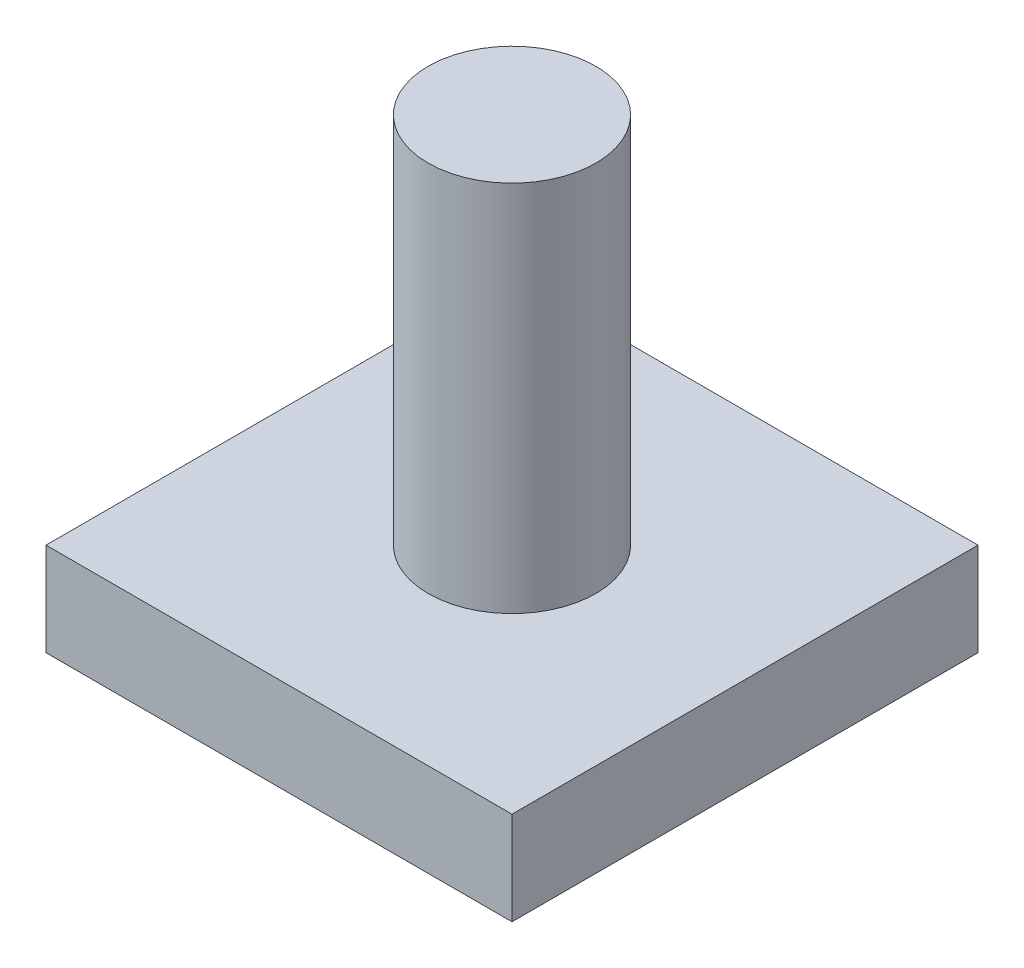
ISO-10303-21;
HEADER;
FILE_DESCRIPTION(('STEP AP214'),'2;1');
FILE_NAME('part.step','',(''),(''),'','','');
FILE_SCHEMA(('AUTOMOTIVE_DESIGN { 1 0 10303 214 1 1 1 1 }'));
ENDSEC;
DATA;
#1=APPLICATION_CONTEXT('core data for automotive mechanical design processes');
#2=APPLICATION_PROTOCOL_DEFINITION('international standard','automotive_design',2000,#1);
#3=PRODUCT_CONTEXT('',#1,'mechanical');
#4=PRODUCT('Part','Part','',(#3));
#5=PRODUCT_RELATED_PRODUCT_CATEGORY('part','',(#4));
#6=PRODUCT_DEFINITION_FORMATION('','',#4);
#7=PRODUCT_DEFINITION_CONTEXT('part definition',#1,'design');
#8=PRODUCT_DEFINITION('design','',#6,#7);
#9=PRODUCT_DEFINITION_SHAPE('','',#8);
#10=(LENGTH_UNIT() NAMED_UNIT(*) SI_UNIT(.MILLI.,.METRE.));
#11=(NAMED_UNIT(*) PLANE_ANGLE_UNIT() SI_UNIT($,.RADIAN.));
#12=(NAMED_UNIT(*) SI_UNIT($,.STERADIAN.) SOLID_ANGLE_UNIT());
#13=UNCERTAINTY_MEASURE_WITH_UNIT(LENGTH_MEASURE(1.E-05),#10,'distance_accuracy_value','');
#14=(GEOMETRIC_REPRESENTATION_CONTEXT(3) GLOBAL_UNCERTAINTY_ASSIGNED_CONTEXT((#13)) GLOBAL_UNIT_ASSIGNED_CONTEXT((#10,
#11,#12)) REPRESENTATION_CONTEXT('',''));
#15=CARTESIAN_POINT('',(0.,0.,0.));
#16=DIRECTION('',(0.,0.,1.));
#17=DIRECTION('',(1.,0.,0.));
#18=AXIS2_PLACEMENT_3D('',#15,#16,#17);
#19=CARTESIAN_POINT('',(2.5,1.,-2.5));
#20=DIRECTION('',(-1.,0.,0.));
#21=DIRECTION('',(0.,0.,1.));
#22=AXIS2_PLACEMENT_3D('',#19,#20,#21);
#23=PLANE('',#22);
#24=DIRECTION('',(0.,0.,-1.));
#25=VECTOR('',#24,1.);
#26=CARTESIAN_POINT('',(2.5,0.,-2.5));
#27=LINE('',#26,#25);
#28=CARTESIAN_POINT('',(2.5,0.,2.5));
#29=VERTEX_POINT('',#28);
#30=CARTESIAN_POINT('',(2.5,0.,-2.5));
#31=VERTEX_POINT('',#30);
#32=EDGE_CURVE('E96',#29,#31,#27,.T.);
#33=ORIENTED_EDGE('',*,*,#32,.T.);
#34=DIRECTION('',(0.,-1.,0.));
#35=VECTOR('',#34,1.);
#36=CARTESIAN_POINT('',(2.5,1.,-2.5));
#37=LINE('',#36,#35);
#38=CARTESIAN_POINT('',(2.5,1.,-2.5));
#39=VERTEX_POINT('',#38);
#40=EDGE_CURVE('E11',#39,#31,#37,.T.);
#41=ORIENTED_EDGE('',*,*,#40,.F.);
#42=DIRECTION('',(0.,0.,-1.));
#43=VECTOR('',#42,1.);
#44=CARTESIAN_POINT('',(2.5,1.,-2.5));
#45=LINE('',#44,#43);
#46=CARTESIAN_POINT('',(2.5,1.,2.5));
#47=VERTEX_POINT('',#46);
#48=EDGE_CURVE('E84',#47,#39,#45,.T.);
#49=ORIENTED_EDGE('',*,*,#48,.F.);
#50=DIRECTION('',(0.,-1.,0.));
#51=VECTOR('',#50,1.);
#52=CARTESIAN_POINT('',(2.5,1.,2.5));
#53=LINE('',#52,#51);
#54=EDGE_CURVE('E92',#47,#29,#53,.T.);
#55=ORIENTED_EDGE('',*,*,#54,.T.);
#56=EDGE_LOOP('',(#33,#41,#49,#55));
#57=FACE_BOUND('',#56,.T.);
#58=ADVANCED_FACE('F33',(#57),#23,.F.);
#59=CARTESIAN_POINT('',(-2.5,1.,-2.5));
#60=DIRECTION('',(0.,0.,1.));
#61=DIRECTION('',(1.,0.,0.));
#62=AXIS2_PLACEMENT_3D('',#59,#60,#61);
#63=PLANE('',#62);
#64=DIRECTION('',(-1.,0.,0.));
#65=VECTOR('',#64,1.);
#66=CARTESIAN_POINT('',(-2.5,0.,-2.5));
#67=LINE('',#66,#65);
#68=CARTESIAN_POINT('',(-2.5,0.,-2.5));
#69=VERTEX_POINT('',#68);
#70=EDGE_CURVE('E88',#31,#69,#67,.T.);
#71=ORIENTED_EDGE('',*,*,#70,.T.);
#72=DIRECTION('',(0.,-1.,0.));
#73=VECTOR('',#72,1.);
#74=CARTESIAN_POINT('',(-2.5,1.,-2.5));
#75=LINE('',#74,#73);
#76=CARTESIAN_POINT('',(-2.5,1.,-2.5));
#77=VERTEX_POINT('',#76);
#78=EDGE_CURVE('E41',#77,#69,#75,.T.);
#79=ORIENTED_EDGE('',*,*,#78,.F.);
#80=DIRECTION('',(-1.,0.,0.));
#81=VECTOR('',#80,1.);
#82=CARTESIAN_POINT('',(-2.5,1.,-2.5));
#83=LINE('',#82,#81);
#84=EDGE_CURVE('E79',#39,#77,#83,.T.);
#85=ORIENTED_EDGE('',*,*,#84,.F.);
#86=ORIENTED_EDGE('',*,*,#40,.T.);
#87=EDGE_LOOP('',(#71,#79,#85,#86));
#88=FACE_BOUND('',#87,.T.);
#89=ADVANCED_FACE('F87',(#88),#63,.F.);
#90=CARTESIAN_POINT('',(-2.5,1.,-2.5));
#91=DIRECTION('',(1.,0.,0.));
#92=DIRECTION('',(0.,0.,-1.));
#93=AXIS2_PLACEMENT_3D('',#90,#91,#92);
#94=PLANE('',#93);
#95=DIRECTION('',(0.,0.,1.));
#96=VECTOR('',#95,1.);
#97=CARTESIAN_POINT('',(-2.5,0.,-2.5));
#98=LINE('',#97,#96);
#99=CARTESIAN_POINT('',(-2.5,0.,2.5));
#100=VERTEX_POINT('',#99);
#101=EDGE_CURVE('E66',#69,#100,#98,.T.);
#102=ORIENTED_EDGE('',*,*,#101,.T.);
#103=DIRECTION('',(0.,-1.,0.));
#104=VECTOR('',#103,1.);
#105=CARTESIAN_POINT('',(-2.5,1.,2.5));
#106=LINE('',#105,#104);
#107=CARTESIAN_POINT('',(-2.5,1.,2.5));
#108=VERTEX_POINT('',#107);
#109=EDGE_CURVE('E89',#108,#100,#106,.T.);
#110=ORIENTED_EDGE('',*,*,#109,.F.);
#111=DIRECTION('',(0.,0.,1.));
#112=VECTOR('',#111,1.);
#113=CARTESIAN_POINT('',(-2.5,1.,-2.5));
#114=LINE('',#113,#112);
#115=EDGE_CURVE('E82',#77,#108,#114,.T.);
#116=ORIENTED_EDGE('',*,*,#115,.F.);
#117=ORIENTED_EDGE('',*,*,#78,.T.);
#118=EDGE_LOOP('',(#102,#110,#116,#117));
#119=FACE_BOUND('',#118,.T.);
#120=ADVANCED_FACE('F90',(#119),#94,.F.);
#121=CARTESIAN_POINT('',(-2.5,1.,2.5));
#122=DIRECTION('',(0.,0.,-1.));
#123=DIRECTION('',(-1.,0.,0.));
#124=AXIS2_PLACEMENT_3D('',#121,#122,#123);
#125=PLANE('',#124);
#126=DIRECTION('',(1.,0.,0.));
#127=VECTOR('',#126,1.);
#128=CARTESIAN_POINT('',(-2.5,0.,2.5));
#129=LINE('',#128,#127);
#130=EDGE_CURVE('E72',#100,#29,#129,.T.);
#131=ORIENTED_EDGE('',*,*,#130,.T.);
#132=ORIENTED_EDGE('',*,*,#54,.F.);
#133=DIRECTION('',(1.,0.,0.));
#134=VECTOR('',#133,1.);
#135=CARTESIAN_POINT('',(-2.5,1.,2.5));
#136=LINE('',#135,#134);
#137=EDGE_CURVE('E49',#108,#47,#136,.T.);
#138=ORIENTED_EDGE('',*,*,#137,.F.);
#139=ORIENTED_EDGE('',*,*,#109,.T.);
#140=EDGE_LOOP('',(#131,#132,#138,#139));
#141=FACE_BOUND('',#140,.T.);
#142=ADVANCED_FACE('F104',(#141),#125,.F.);
#143=CARTESIAN_POINT('',(0.,1.,0.));
#144=DIRECTION('',(0.,1.,0.));
#145=DIRECTION('',(0.,0.,1.));
#146=AXIS2_PLACEMENT_3D('',#143,#144,#145);
#147=PLANE('',#146);
#148=CARTESIAN_POINT('',(0.,1.,0.));
#149=DIRECTION('',(0.,1.,0.));
#150=DIRECTION('',(0.,0.,1.));
#151=AXIS2_PLACEMENT_3D('',#148,#149,#150);
#152=CIRCLE('',#151,0.9);
#153=CARTESIAN_POINT('',(0.,1.,0.9));
#154=VERTEX_POINT('',#153);
#155=EDGE_CURVE('E99',#154,#154,#152,.F.);
#156=ORIENTED_EDGE('',*,*,#155,.T.);
#157=EDGE_LOOP('',(#156));
#158=FACE_BOUND('',#157,.T.);
#159=ORIENTED_EDGE('',*,*,#48,.T.);
#160=ORIENTED_EDGE('',*,*,#84,.T.);
#161=ORIENTED_EDGE('',*,*,#115,.T.);
#162=ORIENTED_EDGE('',*,*,#137,.T.);
#163=EDGE_LOOP('',(#159,#160,#161,#162));
#164=FACE_BOUND('',#163,.T.);
#165=ADVANCED_FACE('F80',(#158,#164),#147,.T.);
#166=CARTESIAN_POINT('',(0.,0.,0.));
#167=DIRECTION('',(0.,1.,0.));
#168=DIRECTION('',(0.,0.,1.));
#169=AXIS2_PLACEMENT_3D('',#166,#167,#168);
#170=PLANE('',#169);
#171=ORIENTED_EDGE('',*,*,#32,.F.);
#172=ORIENTED_EDGE('',*,*,#130,.F.);
#173=ORIENTED_EDGE('',*,*,#101,.F.);
#174=ORIENTED_EDGE('',*,*,#70,.F.);
#175=EDGE_LOOP('',(#171,#172,#173,#174));
#176=FACE_BOUND('',#175,.T.);
#177=ADVANCED_FACE('F107',(#176),#170,.F.);
#178=CARTESIAN_POINT('',(0.,5.,0.));
#179=DIRECTION('',(0.,-1.,0.));
#180=DIRECTION('',(0.,0.,-1.));
#181=AXIS2_PLACEMENT_3D('',#178,#179,#180);
#182=CYLINDRICAL_SURFACE('',#181,0.9);
#183=ORIENTED_EDGE('',*,*,#155,.F.);
#184=EDGE_LOOP('',(#183));
#185=FACE_BOUND('',#184,.T.);
#186=CARTESIAN_POINT('',(0.,5.,0.));
#187=DIRECTION('',(0.,1.,0.));
#188=DIRECTION('',(0.,0.,1.));
#189=AXIS2_PLACEMENT_3D('',#186,#187,#188);
#190=CIRCLE('',#189,0.9);
#191=CARTESIAN_POINT('',(0.,5.,0.9));
#192=VERTEX_POINT('',#191);
#193=EDGE_CURVE('E112',#192,#192,#190,.T.);
#194=ORIENTED_EDGE('',*,*,#193,.F.);
#195=EDGE_LOOP('',(#194));
#196=FACE_BOUND('',#195,.T.);
#197=ADVANCED_FACE('F118',(#185,#196),#182,.T.);
#198=CARTESIAN_POINT('',(0.,5.,0.));
#199=DIRECTION('',(0.,1.,0.));
#200=DIRECTION('',(0.,0.,1.));
#201=AXIS2_PLACEMENT_3D('',#198,#199,#200);
#202=PLANE('',#201);
#203=ORIENTED_EDGE('',*,*,#193,.T.);
#204=EDGE_LOOP('',(#203));
#205=FACE_BOUND('',#204,.T.);
#206=ADVANCED_FACE('F116',(#205),#202,.T.);
#207=CLOSED_SHELL('',(#58,#89,#120,#142,#165,#177,#197,#206));
#208=MANIFOLD_SOLID_BREP('B2',#207);
#209=ADVANCED_BREP_SHAPE_REPRESENTATION('',(#18,#208),#14);
#210=SHAPE_DEFINITION_REPRESENTATION(#9,#209);
ENDSEC;
END-ISO-10303-21;
